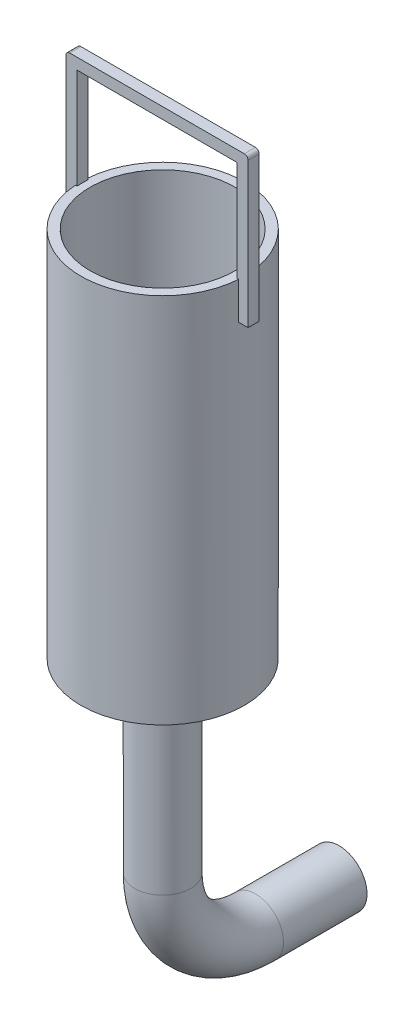
ISO-10303-21;
HEADER;
FILE_DESCRIPTION(('STEP AP214'),'2;1');
FILE_NAME('part.step','',(''),(''),'','','');
FILE_SCHEMA(('AUTOMOTIVE_DESIGN { 1 0 10303 214 1 1 1 1 }'));
ENDSEC;
DATA;
#1=APPLICATION_CONTEXT('core data for automotive mechanical design processes');
#2=APPLICATION_PROTOCOL_DEFINITION('international standard','automotive_design',2000,#1);
#3=PRODUCT_CONTEXT('',#1,'mechanical');
#4=PRODUCT('Part','Part','',(#3));
#5=PRODUCT_RELATED_PRODUCT_CATEGORY('part','',(#4));
#6=PRODUCT_DEFINITION_FORMATION('','',#4);
#7=PRODUCT_DEFINITION_CONTEXT('part definition',#1,'design');
#8=PRODUCT_DEFINITION('design','',#6,#7);
#9=PRODUCT_DEFINITION_SHAPE('','',#8);
#10=(LENGTH_UNIT() NAMED_UNIT(*) SI_UNIT(.MILLI.,.METRE.));
#11=(NAMED_UNIT(*) PLANE_ANGLE_UNIT() SI_UNIT($,.RADIAN.));
#12=(NAMED_UNIT(*) SI_UNIT($,.STERADIAN.) SOLID_ANGLE_UNIT());
#13=UNCERTAINTY_MEASURE_WITH_UNIT(LENGTH_MEASURE(1.E-05),#10,'distance_accuracy_value','');
#14=(GEOMETRIC_REPRESENTATION_CONTEXT(3) GLOBAL_UNCERTAINTY_ASSIGNED_CONTEXT((#13)) GLOBAL_UNIT_ASSIGNED_CONTEXT((#10,
#11,#12)) REPRESENTATION_CONTEXT('',''));
#15=CARTESIAN_POINT('',(0.,0.,0.));
#16=DIRECTION('',(0.,0.,1.));
#17=DIRECTION('',(1.,0.,0.));
#18=AXIS2_PLACEMENT_3D('',#15,#16,#17);
#19=CARTESIAN_POINT('',(0.,0.,0.));
#20=DIRECTION('',(0.,-1.,0.));
#21=DIRECTION('',(0.,0.,-1.));
#22=AXIS2_PLACEMENT_3D('',#19,#20,#21);
#23=PLANE('',#22);
#24=CARTESIAN_POINT('',(0.,0.,0.));
#25=DIRECTION('',(0.,-1.,0.));
#26=DIRECTION('',(0.,0.,-1.));
#27=AXIS2_PLACEMENT_3D('',#24,#25,#26);
#28=CIRCLE('',#27,14.);
#29=CARTESIAN_POINT('',(0.,0.,-14.));
#30=VERTEX_POINT('',#29);
#31=EDGE_CURVE('E90',#30,#30,#28,.T.);
#32=ORIENTED_EDGE('',*,*,#31,.T.);
#33=EDGE_LOOP('',(#32));
#34=FACE_BOUND('',#33,.T.);
#35=CARTESIAN_POINT('',(0.,0.,0.));
#36=DIRECTION('',(0.,-1.,0.));
#37=DIRECTION('',(0.,0.,-1.));
#38=AXIS2_PLACEMENT_3D('',#35,#36,#37);
#39=CIRCLE('',#38,15.);
#40=CARTESIAN_POINT('',(0.,0.,-15.));
#41=VERTEX_POINT('',#40);
#42=EDGE_CURVE('E81',#41,#41,#39,.T.);
#43=ORIENTED_EDGE('',*,*,#42,.F.);
#44=EDGE_LOOP('',(#43));
#45=FACE_BOUND('',#44,.T.);
#46=ADVANCED_FACE('F67',(#34,#45),#23,.F.);
#47=CARTESIAN_POINT('',(4.44089209850063E-13,-149.810784889397,-94.9506304164396));
#48=DIRECTION('',(0.,0.,-1.));
#49=DIRECTION('',(0.,1.,0.));
#50=AXIS2_PLACEMENT_3D('',#47,#48,#49);
#51=PLANE('',#50);
#52=CARTESIAN_POINT('',(4.44089209850063E-13,-149.810784889397,-94.9506304164396));
#53=DIRECTION('',(0.,0.,-1.));
#54=DIRECTION('',(-1.,0.,0.));
#55=AXIS2_PLACEMENT_3D('',#52,#53,#54);
#56=CIRCLE('',#55,14.);
#57=CARTESIAN_POINT('',(-13.9999999999996,-149.810784889397,-94.9506304164397));
#58=VERTEX_POINT('',#57);
#59=EDGE_CURVE('E86',#58,#58,#56,.T.);
#60=ORIENTED_EDGE('',*,*,#59,.F.);
#61=EDGE_LOOP('',(#60));
#62=FACE_BOUND('',#61,.T.);
#63=CARTESIAN_POINT('',(4.44089209850063E-13,-149.810784889397,-94.9506304164396));
#64=DIRECTION('',(0.,0.,-1.));
#65=DIRECTION('',(0.,1.,0.));
#66=AXIS2_PLACEMENT_3D('',#63,#64,#65);
#67=CIRCLE('',#66,15.);
#68=CARTESIAN_POINT('',(4.44089209850063E-13,-134.810784889397,-94.9506304164395));
#69=VERTEX_POINT('',#68);
#70=EDGE_CURVE('E12',#69,#69,#67,.T.);
#71=ORIENTED_EDGE('',*,*,#70,.T.);
#72=EDGE_LOOP('',(#71));
#73=FACE_BOUND('',#72,.T.);
#74=ADVANCED_FACE('F126',(#62,#73),#51,.T.);
#75=CARTESIAN_POINT('',(0.,0.,0.));
#76=DIRECTION('',(0.,-1.,0.));
#77=DIRECTION('',(0.,0.,-1.));
#78=AXIS2_PLACEMENT_3D('',#75,#76,#77);
#79=CYLINDRICAL_SURFACE('',#78,15.);
#80=CARTESIAN_POINT('',(0.,-99.8107848893968,0.));
#81=DIRECTION('',(0.,-1.,0.));
#82=DIRECTION('',(0.,0.,-1.));
#83=AXIS2_PLACEMENT_3D('',#80,#81,#82);
#84=CIRCLE('',#83,15.);
#85=CARTESIAN_POINT('',(0.,-99.8107848893967,15.));
#86=VERTEX_POINT('',#85);
#87=EDGE_CURVE('E77',#86,#86,#84,.T.);
#88=ORIENTED_EDGE('',*,*,#87,.F.);
#89=EDGE_LOOP('',(#88));
#90=FACE_BOUND('',#89,.T.);
#91=ORIENTED_EDGE('',*,*,#42,.T.);
#92=EDGE_LOOP('',(#91));
#93=FACE_BOUND('',#92,.T.);
#94=ADVANCED_FACE('F122',(#90,#93),#79,.T.);
#95=CARTESIAN_POINT('',(0.,-99.8107848893968,-50.));
#96=DIRECTION('',(1.,0.,0.));
#97=DIRECTION('',(0.,0.,-1.));
#98=AXIS2_PLACEMENT_3D('',#95,#96,#97);
#99=TOROIDAL_SURFACE('',#98,50.,15.);
#100=CARTESIAN_POINT('',(0.,-149.810784889397,-50.));
#101=DIRECTION('',(0.,0.,-1.));
#102=DIRECTION('',(0.,1.,0.));
#103=AXIS2_PLACEMENT_3D('',#100,#101,#102);
#104=CIRCLE('',#103,15.);
#105=CARTESIAN_POINT('',(0.,-164.810784889397,-50.));
#106=VERTEX_POINT('',#105);
#107=EDGE_CURVE('E73',#106,#106,#104,.T.);
#108=CARTESIAN_POINT('',(0.,-99.8107848893968,-50.));
#109=DIRECTION('',(1.,0.,0.));
#110=DIRECTION('',(0.,0.,-1.));
#111=AXIS2_PLACEMENT_3D('',#108,#109,#110);
#112=CIRCLE('',#111,65.);
#113=EDGE_CURVE('',#86,#106,#112,.T.);
#114=ORIENTED_EDGE('',*,*,#87,.T.);
#115=ORIENTED_EDGE('',*,*,#107,.F.);
#116=ORIENTED_EDGE('',*,*,#113,.T.);
#117=ORIENTED_EDGE('',*,*,#113,.F.);
#118=EDGE_LOOP('',(#114,#116,#115,#117));
#119=FACE_BOUND('',#118,.T.);
#120=ADVANCED_FACE('F116',(#119),#99,.T.);
#121=CARTESIAN_POINT('',(0.,-149.810784889397,-50.));
#122=DIRECTION('',(0.,0.,-1.));
#123=DIRECTION('',(-1.,0.,0.));
#124=AXIS2_PLACEMENT_3D('',#121,#122,#123);
#125=CYLINDRICAL_SURFACE('',#124,15.);
#126=ORIENTED_EDGE('',*,*,#70,.F.);
#127=EDGE_LOOP('',(#126));
#128=FACE_BOUND('',#127,.T.);
#129=ORIENTED_EDGE('',*,*,#107,.T.);
#130=EDGE_LOOP('',(#129));
#131=FACE_BOUND('',#130,.T.);
#132=ADVANCED_FACE('F113',(#128,#131),#125,.T.);
#133=CARTESIAN_POINT('',(0.,0.,0.));
#134=DIRECTION('',(0.,-1.,0.));
#135=DIRECTION('',(0.,0.,-1.));
#136=AXIS2_PLACEMENT_3D('',#133,#134,#135);
#137=CYLINDRICAL_SURFACE('',#136,14.);
#138=CARTESIAN_POINT('',(0.,-99.8107848893968,0.));
#139=DIRECTION('',(0.,1.,0.));
#140=DIRECTION('',(0.,0.,1.));
#141=AXIS2_PLACEMENT_3D('',#138,#139,#140);
#142=CIRCLE('',#141,14.);
#143=CARTESIAN_POINT('',(0.,-99.8107848893967,14.));
#144=VERTEX_POINT('',#143);
#145=EDGE_CURVE('E93',#144,#144,#142,.F.);
#146=ORIENTED_EDGE('',*,*,#145,.T.);
#147=EDGE_LOOP('',(#146));
#148=FACE_BOUND('',#147,.T.);
#149=ORIENTED_EDGE('',*,*,#31,.F.);
#150=EDGE_LOOP('',(#149));
#151=FACE_BOUND('',#150,.T.);
#152=ADVANCED_FACE('F99',(#148,#151),#137,.F.);
#153=CARTESIAN_POINT('',(0.,-99.8107848893968,-50.));
#154=DIRECTION('',(1.,0.,0.));
#155=DIRECTION('',(0.,0.,-1.));
#156=AXIS2_PLACEMENT_3D('',#153,#154,#155);
#157=TOROIDAL_SURFACE('',#156,50.,14.);
#158=CARTESIAN_POINT('',(0.,-149.810784889397,-50.));
#159=DIRECTION('',(0.,0.,-1.));
#160=DIRECTION('',(-1.,0.,0.));
#161=AXIS2_PLACEMENT_3D('',#158,#159,#160);
#162=CIRCLE('',#161,14.);
#163=CARTESIAN_POINT('',(0.,-163.810784889397,-50.));
#164=VERTEX_POINT('',#163);
#165=EDGE_CURVE('E89',#164,#164,#162,.T.);
#166=CARTESIAN_POINT('',(0.,-99.8107848893968,-50.));
#167=DIRECTION('',(1.,0.,0.));
#168=DIRECTION('',(0.,0.,-1.));
#169=AXIS2_PLACEMENT_3D('',#166,#167,#168);
#170=CIRCLE('',#169,64.);
#171=EDGE_CURVE('',#144,#164,#170,.T.);
#172=ORIENTED_EDGE('',*,*,#145,.F.);
#173=ORIENTED_EDGE('',*,*,#165,.T.);
#174=ORIENTED_EDGE('',*,*,#171,.T.);
#175=ORIENTED_EDGE('',*,*,#171,.F.);
#176=EDGE_LOOP('',(#172,#174,#173,#175));
#177=FACE_BOUND('',#176,.T.);
#178=ADVANCED_FACE('F102',(#177),#157,.F.);
#179=CARTESIAN_POINT('',(0.,-149.810784889397,-50.));
#180=DIRECTION('',(0.,0.,-1.));
#181=DIRECTION('',(-1.,0.,0.));
#182=AXIS2_PLACEMENT_3D('',#179,#180,#181);
#183=CYLINDRICAL_SURFACE('',#182,14.);
#184=ORIENTED_EDGE('',*,*,#59,.T.);
#185=EDGE_LOOP('',(#184));
#186=FACE_BOUND('',#185,.T.);
#187=ORIENTED_EDGE('',*,*,#165,.F.);
#188=EDGE_LOOP('',(#187));
#189=FACE_BOUND('',#188,.T.);
#190=ADVANCED_FACE('F104',(#186,#189),#183,.F.);
#191=CLOSED_SHELL('',(#46,#74,#94,#120,#132,#152,#178,#190));
#192=MANIFOLD_SOLID_BREP('B2',#191);
#193=CARTESIAN_POINT('',(0.,200.,0.));
#194=DIRECTION('',(0.,-1.,0.));
#195=DIRECTION('',(0.,0.,-1.));
#196=AXIS2_PLACEMENT_3D('',#193,#194,#195);
#197=CYLINDRICAL_SURFACE('',#196,44.);
#198=CARTESIAN_POINT('',(0.,0.,0.));
#199=DIRECTION('',(0.,1.,0.));
#200=DIRECTION('',(0.,0.,1.));
#201=AXIS2_PLACEMENT_3D('',#198,#199,#200);
#202=CIRCLE('',#201,44.);
#203=CARTESIAN_POINT('',(0.,0.,44.));
#204=VERTEX_POINT('',#203);
#205=EDGE_CURVE('E398',#204,#204,#202,.T.);
#206=ORIENTED_EDGE('',*,*,#205,.T.);
#207=EDGE_LOOP('',(#206));
#208=FACE_BOUND('',#207,.T.);
#209=DIRECTION('',(0.,-1.,0.));
#210=VECTOR('',#209,1.);
#211=CARTESIAN_POINT('',(-43.8976081352959,200.,-3.));
#212=LINE('',#211,#210);
#213=CARTESIAN_POINT('',(-43.8976081352959,200.,-3.));
#214=VERTEX_POINT('',#213);
#215=CARTESIAN_POINT('',(-43.8976081352959,180.,-3.));
#216=VERTEX_POINT('',#215);
#217=EDGE_CURVE('E385',#214,#216,#212,.T.);
#218=ORIENTED_EDGE('',*,*,#217,.F.);
#219=CARTESIAN_POINT('',(0.,200.,0.));
#220=DIRECTION('',(0.,1.,0.));
#221=DIRECTION('',(0.,0.,1.));
#222=AXIS2_PLACEMENT_3D('',#219,#220,#221);
#223=CIRCLE('',#222,44.);
#224=CARTESIAN_POINT('',(43.8976081352959,200.,-3.));
#225=VERTEX_POINT('',#224);
#226=EDGE_CURVE('E403',#225,#214,#223,.T.);
#227=ORIENTED_EDGE('',*,*,#226,.F.);
#228=DIRECTION('',(0.,-1.,0.));
#229=VECTOR('',#228,1.);
#230=CARTESIAN_POINT('',(43.8976081352959,200.,-3.));
#231=LINE('',#230,#229);
#232=CARTESIAN_POINT('',(43.8976081352959,180.,-3.));
#233=VERTEX_POINT('',#232);
#234=EDGE_CURVE('E382',#233,#225,#231,.F.);
#235=ORIENTED_EDGE('',*,*,#234,.F.);
#236=CARTESIAN_POINT('',(0.,180.,0.));
#237=DIRECTION('',(0.,1.,0.));
#238=DIRECTION('',(0.,0.,1.));
#239=AXIS2_PLACEMENT_3D('',#236,#237,#238);
#240=CIRCLE('',#239,44.);
#241=CARTESIAN_POINT('',(43.8976081352959,180.,3.));
#242=VERTEX_POINT('',#241);
#243=EDGE_CURVE('E418',#242,#233,#240,.T.);
#244=ORIENTED_EDGE('',*,*,#243,.F.);
#245=DIRECTION('',(0.,-1.,0.));
#246=VECTOR('',#245,1.);
#247=CARTESIAN_POINT('',(43.8976081352959,200.,3.));
#248=LINE('',#247,#246);
#249=CARTESIAN_POINT('',(43.8976081352959,200.,3.));
#250=VERTEX_POINT('',#249);
#251=EDGE_CURVE('E339',#242,#250,#248,.F.);
#252=ORIENTED_EDGE('',*,*,#251,.T.);
#253=CARTESIAN_POINT('',(-43.8976081352959,200.,3.));
#254=VERTEX_POINT('',#253);
#255=EDGE_CURVE('E401',#254,#250,#223,.T.);
#256=ORIENTED_EDGE('',*,*,#255,.F.);
#257=DIRECTION('',(0.,-1.,0.));
#258=VECTOR('',#257,1.);
#259=CARTESIAN_POINT('',(-43.8976081352959,200.,3.));
#260=LINE('',#259,#258);
#261=CARTESIAN_POINT('',(-43.8976081352959,180.,3.));
#262=VERTEX_POINT('',#261);
#263=EDGE_CURVE('E380',#254,#262,#260,.T.);
#264=ORIENTED_EDGE('',*,*,#263,.T.);
#265=CARTESIAN_POINT('',(0.,180.,0.));
#266=DIRECTION('',(0.,1.,0.));
#267=DIRECTION('',(0.,0.,1.));
#268=AXIS2_PLACEMENT_3D('',#265,#266,#267);
#269=CIRCLE('',#268,44.);
#270=EDGE_CURVE('E420',#216,#262,#269,.T.);
#271=ORIENTED_EDGE('',*,*,#270,.F.);
#272=EDGE_LOOP('',(#218,#227,#235,#244,#252,#256,#264,#271));
#273=FACE_BOUND('',#272,.T.);
#274=ADVANCED_FACE('F210',(#208,#273),#197,.T.);
#275=CARTESIAN_POINT('',(0.,200.,0.));
#276=DIRECTION('',(0.,1.,0.));
#277=DIRECTION('',(0.,0.,1.));
#278=AXIS2_PLACEMENT_3D('',#275,#276,#277);
#279=PLANE('',#278);
#280=CARTESIAN_POINT('',(0.,200.,0.));
#281=DIRECTION('',(0.,1.,0.));
#282=DIRECTION('',(0.,0.,1.));
#283=AXIS2_PLACEMENT_3D('',#280,#281,#282);
#284=CIRCLE('',#283,39.);
#285=CARTESIAN_POINT('',(0.,200.,39.));
#286=VERTEX_POINT('',#285);
#287=EDGE_CURVE('E394',#286,#286,#284,.T.);
#288=ORIENTED_EDGE('',*,*,#287,.F.);
#289=EDGE_LOOP('',(#288));
#290=FACE_BOUND('',#289,.T.);
#291=ORIENTED_EDGE('',*,*,#226,.T.);
#292=DIRECTION('',(1.,0.,0.));
#293=VECTOR('',#292,1.);
#294=CARTESIAN_POINT('',(0.,200.,-3.));
#295=LINE('',#294,#293);
#296=CARTESIAN_POINT('',(-43.040737884966,200.,-3.));
#297=VERTEX_POINT('',#296);
#298=EDGE_CURVE('E414',#214,#297,#295,.T.);
#299=ORIENTED_EDGE('',*,*,#298,.T.);
#300=DIRECTION('',(0.,0.,-1.));
#301=VECTOR('',#300,1.);
#302=CARTESIAN_POINT('',(-43.040737884966,200.,0.));
#303=LINE('',#302,#301);
#304=CARTESIAN_POINT('',(-43.040737884966,200.,3.));
#305=VERTEX_POINT('',#304);
#306=EDGE_CURVE('E415',#305,#297,#303,.T.);
#307=ORIENTED_EDGE('',*,*,#306,.F.);
#308=DIRECTION('',(1.,0.,0.));
#309=VECTOR('',#308,1.);
#310=CARTESIAN_POINT('',(0.,200.,3.));
#311=LINE('',#310,#309);
#312=EDGE_CURVE('E409',#254,#305,#311,.T.);
#313=ORIENTED_EDGE('',*,*,#312,.F.);
#314=ORIENTED_EDGE('',*,*,#255,.T.);
#315=CARTESIAN_POINT('',(42.9427831631923,200.,3.));
#316=VERTEX_POINT('',#315);
#317=EDGE_CURVE('E406',#316,#250,#311,.T.);
#318=ORIENTED_EDGE('',*,*,#317,.F.);
#319=DIRECTION('',(0.,0.,1.));
#320=VECTOR('',#319,1.);
#321=CARTESIAN_POINT('',(42.9427831631923,200.,0.));
#322=LINE('',#321,#320);
#323=CARTESIAN_POINT('',(42.9427831631923,200.,-3.));
#324=VERTEX_POINT('',#323);
#325=EDGE_CURVE('E408',#324,#316,#322,.T.);
#326=ORIENTED_EDGE('',*,*,#325,.F.);
#327=EDGE_CURVE('E412',#324,#225,#295,.T.);
#328=ORIENTED_EDGE('',*,*,#327,.T.);
#329=EDGE_LOOP('',(#291,#299,#307,#313,#314,#318,#326,#328));
#330=FACE_BOUND('',#329,.T.);
#331=ADVANCED_FACE('F456',(#290,#330),#279,.T.);
#332=CARTESIAN_POINT('',(0.,0.,0.));
#333=DIRECTION('',(0.,1.,0.));
#334=DIRECTION('',(0.,0.,1.));
#335=AXIS2_PLACEMENT_3D('',#332,#333,#334);
#336=PLANE('',#335);
#337=CARTESIAN_POINT('',(0.,0.,0.));
#338=DIRECTION('',(0.,1.,0.));
#339=DIRECTION('',(0.,0.,1.));
#340=AXIS2_PLACEMENT_3D('',#337,#338,#339);
#341=CIRCLE('',#340,15.7);
#342=CARTESIAN_POINT('',(0.,0.,15.7));
#343=VERTEX_POINT('',#342);
#344=EDGE_CURVE('E391',#343,#343,#341,.F.);
#345=ORIENTED_EDGE('',*,*,#344,.F.);
#346=EDGE_LOOP('',(#345));
#347=FACE_BOUND('',#346,.T.);
#348=ORIENTED_EDGE('',*,*,#205,.F.);
#349=EDGE_LOOP('',(#348));
#350=FACE_BOUND('',#349,.T.);
#351=ADVANCED_FACE('F483',(#347,#350),#336,.F.);
#352=CARTESIAN_POINT('',(0.,8.00000000000001,0.));
#353=DIRECTION('',(0.,1.,0.));
#354=DIRECTION('',(0.,0.,1.));
#355=AXIS2_PLACEMENT_3D('',#352,#353,#354);
#356=CYLINDRICAL_SURFACE('',#355,39.);
#357=CARTESIAN_POINT('',(0.,8.00000000000001,0.));
#358=DIRECTION('',(0.,1.,0.));
#359=DIRECTION('',(0.,0.,1.));
#360=AXIS2_PLACEMENT_3D('',#357,#358,#359);
#361=CIRCLE('',#360,39.);
#362=CARTESIAN_POINT('',(0.,8.00000000000001,39.));
#363=VERTEX_POINT('',#362);
#364=EDGE_CURVE('E395',#363,#363,#361,.T.);
#365=ORIENTED_EDGE('',*,*,#364,.F.);
#366=EDGE_LOOP('',(#365));
#367=FACE_BOUND('',#366,.T.);
#368=ORIENTED_EDGE('',*,*,#287,.T.);
#369=EDGE_LOOP('',(#368));
#370=FACE_BOUND('',#369,.T.);
#371=ADVANCED_FACE('F488',(#367,#370),#356,.F.);
#372=CARTESIAN_POINT('',(0.,8.00000000000001,0.));
#373=DIRECTION('',(0.,1.,0.));
#374=DIRECTION('',(0.,0.,1.));
#375=AXIS2_PLACEMENT_3D('',#372,#373,#374);
#376=PLANE('',#375);
#377=CARTESIAN_POINT('',(0.,8.00000000000001,0.));
#378=DIRECTION('',(0.,1.,0.));
#379=DIRECTION('',(0.,0.,1.));
#380=AXIS2_PLACEMENT_3D('',#377,#378,#379);
#381=CIRCLE('',#380,15.7);
#382=CARTESIAN_POINT('',(0.,8.00000000000001,15.7));
#383=VERTEX_POINT('',#382);
#384=EDGE_CURVE('E388',#383,#383,#381,.T.);
#385=ORIENTED_EDGE('',*,*,#384,.F.);
#386=EDGE_LOOP('',(#385));
#387=FACE_BOUND('',#386,.T.);
#388=ORIENTED_EDGE('',*,*,#364,.T.);
#389=EDGE_LOOP('',(#388));
#390=FACE_BOUND('',#389,.T.);
#391=ADVANCED_FACE('F493',(#387,#390),#376,.T.);
#392=CARTESIAN_POINT('',(0.,-0.000999999999999265,0.));
#393=DIRECTION('',(0.,1.,0.));
#394=DIRECTION('',(0.,0.,1.));
#395=AXIS2_PLACEMENT_3D('',#392,#393,#394);
#396=CYLINDRICAL_SURFACE('',#395,15.7);
#397=ORIENTED_EDGE('',*,*,#384,.T.);
#398=EDGE_LOOP('',(#397));
#399=FACE_BOUND('',#398,.T.);
#400=ORIENTED_EDGE('',*,*,#344,.T.);
#401=EDGE_LOOP('',(#400));
#402=FACE_BOUND('',#401,.T.);
#403=ADVANCED_FACE('F497',(#399,#402),#396,.F.);
#404=CARTESIAN_POINT('',(0.,0.,-3.));
#405=DIRECTION('',(0.,0.,1.));
#406=DIRECTION('',(1.,0.,0.));
#407=AXIS2_PLACEMENT_3D('',#404,#405,#406);
#408=PLANE('',#407);
#409=DIRECTION('',(0.,1.,0.));
#410=VECTOR('',#409,1.);
#411=CARTESIAN_POINT('',(-49.040737884966,0.,-3.));
#412=LINE('',#411,#410);
#413=CARTESIAN_POINT('',(-49.040737884966,180.,-3.));
#414=VERTEX_POINT('',#413);
#415=CARTESIAN_POINT('',(-49.040737884966,258.,-3.));
#416=VERTEX_POINT('',#415);
#417=EDGE_CURVE('E364',#414,#416,#412,.T.);
#418=ORIENTED_EDGE('',*,*,#417,.T.);
#419=CARTESIAN_POINT('',(-47.040737884966,258.,-3.));
#420=DIRECTION('',(0.,0.,1.));
#421=DIRECTION('',(1.,0.,0.));
#422=AXIS2_PLACEMENT_3D('',#419,#420,#421);
#423=CIRCLE('',#422,2.);
#424=CARTESIAN_POINT('',(-47.040737884966,260.,-3.));
#425=VERTEX_POINT('',#424);
#426=EDGE_CURVE('E218',#416,#425,#423,.F.);
#427=ORIENTED_EDGE('',*,*,#426,.T.);
#428=DIRECTION('',(1.,0.,0.));
#429=VECTOR('',#428,1.);
#430=CARTESIAN_POINT('',(0.,260.,-3.));
#431=LINE('',#430,#429);
#432=CARTESIAN_POINT('',(46.9427831631922,260.,-3.));
#433=VERTEX_POINT('',#432);
#434=EDGE_CURVE('E362',#425,#433,#431,.T.);
#435=ORIENTED_EDGE('',*,*,#434,.T.);
#436=CARTESIAN_POINT('',(46.9427831631922,258.,-3.));
#437=DIRECTION('',(0.,0.,1.));
#438=DIRECTION('',(1.,0.,0.));
#439=AXIS2_PLACEMENT_3D('',#436,#437,#438);
#440=CIRCLE('',#439,2.);
#441=CARTESIAN_POINT('',(48.9427831631922,258.,-3.));
#442=VERTEX_POINT('',#441);
#443=EDGE_CURVE('E225',#433,#442,#440,.F.);
#444=ORIENTED_EDGE('',*,*,#443,.T.);
#445=DIRECTION('',(0.,-1.,0.));
#446=VECTOR('',#445,1.);
#447=CARTESIAN_POINT('',(48.9427831631923,0.,-3.));
#448=LINE('',#447,#446);
#449=CARTESIAN_POINT('',(48.9427831631922,180.,-3.));
#450=VERTEX_POINT('',#449);
#451=EDGE_CURVE('E360',#442,#450,#448,.T.);
#452=ORIENTED_EDGE('',*,*,#451,.T.);
#453=DIRECTION('',(-1.,0.,0.));
#454=VECTOR('',#453,1.);
#455=CARTESIAN_POINT('',(0.,180.,-3.));
#456=LINE('',#455,#454);
#457=EDGE_CURVE('E330',#450,#233,#456,.T.);
#458=ORIENTED_EDGE('',*,*,#457,.T.);
#459=ORIENTED_EDGE('',*,*,#234,.T.);
#460=ORIENTED_EDGE('',*,*,#327,.F.);
#461=DIRECTION('',(0.,-1.,0.));
#462=VECTOR('',#461,1.);
#463=CARTESIAN_POINT('',(42.9427831631923,0.,-3.));
#464=LINE('',#463,#462);
#465=CARTESIAN_POINT('',(42.9427831631922,254.,-3.));
#466=VERTEX_POINT('',#465);
#467=EDGE_CURVE('E356',#466,#324,#464,.T.);
#468=ORIENTED_EDGE('',*,*,#467,.F.);
#469=DIRECTION('',(1.,0.,0.));
#470=VECTOR('',#469,1.);
#471=CARTESIAN_POINT('',(0.,254.,-3.));
#472=LINE('',#471,#470);
#473=CARTESIAN_POINT('',(-43.040737884966,254.,-3.));
#474=VERTEX_POINT('',#473);
#475=EDGE_CURVE('E332',#474,#466,#472,.T.);
#476=ORIENTED_EDGE('',*,*,#475,.F.);
#477=DIRECTION('',(0.,1.,0.));
#478=VECTOR('',#477,1.);
#479=CARTESIAN_POINT('',(-43.040737884966,0.,-3.));
#480=LINE('',#479,#478);
#481=EDGE_CURVE('E368',#297,#474,#480,.T.);
#482=ORIENTED_EDGE('',*,*,#481,.F.);
#483=ORIENTED_EDGE('',*,*,#298,.F.);
#484=ORIENTED_EDGE('',*,*,#217,.T.);
#485=DIRECTION('',(-1.,0.,0.));
#486=VECTOR('',#485,1.);
#487=CARTESIAN_POINT('',(0.,180.,-3.));
#488=LINE('',#487,#486);
#489=EDGE_CURVE('E366',#216,#414,#488,.T.);
#490=ORIENTED_EDGE('',*,*,#489,.T.);
#491=EDGE_LOOP('',(#418,#427,#435,#444,#452,#458,#459,#460,#468,#476,#482,#483,#484,#490));
#492=FACE_BOUND('',#491,.T.);
#493=ADVANCED_FACE('F435',(#492),#408,.F.);
#494=CARTESIAN_POINT('',(0.,0.,3.));
#495=DIRECTION('',(0.,0.,1.));
#496=DIRECTION('',(1.,0.,0.));
#497=AXIS2_PLACEMENT_3D('',#494,#495,#496);
#498=PLANE('',#497);
#499=DIRECTION('',(1.,0.,0.));
#500=VECTOR('',#499,1.);
#501=CARTESIAN_POINT('',(0.,260.,3.));
#502=LINE('',#501,#500);
#503=CARTESIAN_POINT('',(-47.040737884966,260.,3.));
#504=VERTEX_POINT('',#503);
#505=CARTESIAN_POINT('',(46.9427831631922,260.,3.));
#506=VERTEX_POINT('',#505);
#507=EDGE_CURVE('E322',#504,#506,#502,.T.);
#508=ORIENTED_EDGE('',*,*,#507,.F.);
#509=CARTESIAN_POINT('',(-47.040737884966,258.,3.));
#510=DIRECTION('',(0.,0.,1.));
#511=DIRECTION('',(1.,0.,0.));
#512=AXIS2_PLACEMENT_3D('',#509,#510,#511);
#513=CIRCLE('',#512,2.);
#514=CARTESIAN_POINT('',(-49.040737884966,258.,3.));
#515=VERTEX_POINT('',#514);
#516=EDGE_CURVE('E430',#504,#515,#513,.T.);
#517=ORIENTED_EDGE('',*,*,#516,.T.);
#518=DIRECTION('',(0.,1.,0.));
#519=VECTOR('',#518,1.);
#520=CARTESIAN_POINT('',(-49.040737884966,0.,3.));
#521=LINE('',#520,#519);
#522=CARTESIAN_POINT('',(-49.040737884966,180.,3.));
#523=VERTEX_POINT('',#522);
#524=EDGE_CURVE('E347',#523,#515,#521,.T.);
#525=ORIENTED_EDGE('',*,*,#524,.F.);
#526=DIRECTION('',(-1.,0.,0.));
#527=VECTOR('',#526,1.);
#528=CARTESIAN_POINT('',(0.,180.,3.));
#529=LINE('',#528,#527);
#530=EDGE_CURVE('E349',#262,#523,#529,.T.);
#531=ORIENTED_EDGE('',*,*,#530,.F.);
#532=ORIENTED_EDGE('',*,*,#263,.F.);
#533=ORIENTED_EDGE('',*,*,#312,.T.);
#534=DIRECTION('',(0.,1.,0.));
#535=VECTOR('',#534,1.);
#536=CARTESIAN_POINT('',(-43.040737884966,0.,3.));
#537=LINE('',#536,#535);
#538=CARTESIAN_POINT('',(-43.040737884966,254.,3.));
#539=VERTEX_POINT('',#538);
#540=EDGE_CURVE('E351',#305,#539,#537,.T.);
#541=ORIENTED_EDGE('',*,*,#540,.T.);
#542=DIRECTION('',(1.,0.,0.));
#543=VECTOR('',#542,1.);
#544=CARTESIAN_POINT('',(0.,254.,3.));
#545=LINE('',#544,#543);
#546=CARTESIAN_POINT('',(42.9427831631922,254.,3.));
#547=VERTEX_POINT('',#546);
#548=EDGE_CURVE('E353',#539,#547,#545,.T.);
#549=ORIENTED_EDGE('',*,*,#548,.T.);
#550=DIRECTION('',(0.,-1.,0.));
#551=VECTOR('',#550,1.);
#552=CARTESIAN_POINT('',(42.9427831631923,0.,3.));
#553=LINE('',#552,#551);
#554=EDGE_CURVE('E340',#547,#316,#553,.T.);
#555=ORIENTED_EDGE('',*,*,#554,.T.);
#556=ORIENTED_EDGE('',*,*,#317,.T.);
#557=ORIENTED_EDGE('',*,*,#251,.F.);
#558=DIRECTION('',(-1.,0.,0.));
#559=VECTOR('',#558,1.);
#560=CARTESIAN_POINT('',(0.,180.,3.));
#561=LINE('',#560,#559);
#562=CARTESIAN_POINT('',(48.9427831631922,180.,3.));
#563=VERTEX_POINT('',#562);
#564=EDGE_CURVE('E323',#563,#242,#561,.T.);
#565=ORIENTED_EDGE('',*,*,#564,.F.);
#566=DIRECTION('',(0.,-1.,0.));
#567=VECTOR('',#566,1.);
#568=CARTESIAN_POINT('',(48.9427831631923,0.,3.));
#569=LINE('',#568,#567);
#570=CARTESIAN_POINT('',(48.9427831631922,258.,3.));
#571=VERTEX_POINT('',#570);
#572=EDGE_CURVE('E314',#571,#563,#569,.T.);
#573=ORIENTED_EDGE('',*,*,#572,.F.);
#574=CARTESIAN_POINT('',(46.9427831631922,258.,3.));
#575=DIRECTION('',(0.,0.,1.));
#576=DIRECTION('',(1.,0.,0.));
#577=AXIS2_PLACEMENT_3D('',#574,#575,#576);
#578=CIRCLE('',#577,2.);
#579=EDGE_CURVE('E428',#571,#506,#578,.T.);
#580=ORIENTED_EDGE('',*,*,#579,.T.);
#581=EDGE_LOOP('',(#508,#517,#525,#531,#532,#533,#541,#549,#555,#556,#557,#565,#573,#580));
#582=FACE_BOUND('',#581,.T.);
#583=ADVANCED_FACE('F336',(#582),#498,.T.);
#584=CARTESIAN_POINT('',(42.9427831631923,0.,-3.));
#585=DIRECTION('',(-1.,0.,0.));
#586=DIRECTION('',(0.,-1.,0.));
#587=AXIS2_PLACEMENT_3D('',#584,#585,#586);
#588=PLANE('',#587);
#589=ORIENTED_EDGE('',*,*,#467,.T.);
#590=ORIENTED_EDGE('',*,*,#325,.T.);
#591=ORIENTED_EDGE('',*,*,#554,.F.);
#592=DIRECTION('',(0.,0.,1.));
#593=VECTOR('',#592,1.);
#594=CARTESIAN_POINT('',(42.9427831631922,254.,-3.));
#595=LINE('',#594,#593);
#596=EDGE_CURVE('E372',#466,#547,#595,.T.);
#597=ORIENTED_EDGE('',*,*,#596,.F.);
#598=EDGE_LOOP('',(#589,#590,#591,#597));
#599=FACE_BOUND('',#598,.T.);
#600=ADVANCED_FACE('F470',(#599),#588,.T.);
#601=CARTESIAN_POINT('',(0.,254.,-3.));
#602=DIRECTION('',(0.,-1.,0.));
#603=DIRECTION('',(0.,0.,-1.));
#604=AXIS2_PLACEMENT_3D('',#601,#602,#603);
#605=PLANE('',#604);
#606=ORIENTED_EDGE('',*,*,#596,.T.);
#607=ORIENTED_EDGE('',*,*,#548,.F.);
#608=DIRECTION('',(0.,0.,1.));
#609=VECTOR('',#608,1.);
#610=CARTESIAN_POINT('',(-43.040737884966,254.,-3.));
#611=LINE('',#610,#609);
#612=EDGE_CURVE('E374',#474,#539,#611,.T.);
#613=ORIENTED_EDGE('',*,*,#612,.F.);
#614=ORIENTED_EDGE('',*,*,#475,.T.);
#615=EDGE_LOOP('',(#606,#607,#613,#614));
#616=FACE_BOUND('',#615,.T.);
#617=ADVANCED_FACE('F466',(#616),#605,.T.);
#618=CARTESIAN_POINT('',(-43.040737884966,0.,-3.));
#619=DIRECTION('',(1.,0.,0.));
#620=DIRECTION('',(0.,0.,-1.));
#621=AXIS2_PLACEMENT_3D('',#618,#619,#620);
#622=PLANE('',#621);
#623=ORIENTED_EDGE('',*,*,#540,.F.);
#624=ORIENTED_EDGE('',*,*,#306,.T.);
#625=ORIENTED_EDGE('',*,*,#481,.T.);
#626=ORIENTED_EDGE('',*,*,#612,.T.);
#627=EDGE_LOOP('',(#623,#624,#625,#626));
#628=FACE_BOUND('',#627,.T.);
#629=ADVANCED_FACE('F460',(#628),#622,.T.);
#630=CARTESIAN_POINT('',(0.,180.,-3.));
#631=DIRECTION('',(0.,1.,0.));
#632=DIRECTION('',(0.,0.,1.));
#633=AXIS2_PLACEMENT_3D('',#630,#631,#632);
#634=PLANE('',#633);
#635=ORIENTED_EDGE('',*,*,#489,.F.);
#636=ORIENTED_EDGE('',*,*,#270,.T.);
#637=ORIENTED_EDGE('',*,*,#530,.T.);
#638=DIRECTION('',(0.,0.,1.));
#639=VECTOR('',#638,1.);
#640=CARTESIAN_POINT('',(-49.040737884966,180.,-3.));
#641=LINE('',#640,#639);
#642=EDGE_CURVE('E331',#414,#523,#641,.T.);
#643=ORIENTED_EDGE('',*,*,#642,.F.);
#644=EDGE_LOOP('',(#635,#636,#637,#643));
#645=FACE_BOUND('',#644,.T.);
#646=ADVANCED_FACE('F448',(#645),#634,.F.);
#647=CARTESIAN_POINT('',(-49.040737884966,0.,-3.));
#648=DIRECTION('',(1.,0.,0.));
#649=DIRECTION('',(0.,0.,-1.));
#650=AXIS2_PLACEMENT_3D('',#647,#648,#649);
#651=PLANE('',#650);
#652=ORIENTED_EDGE('',*,*,#524,.T.);
#653=DIRECTION('',(0.,0.,1.));
#654=VECTOR('',#653,1.);
#655=CARTESIAN_POINT('',(-49.040737884966,258.,-3.));
#656=LINE('',#655,#654);
#657=EDGE_CURVE('E233',#515,#416,#656,.F.);
#658=ORIENTED_EDGE('',*,*,#657,.T.);
#659=ORIENTED_EDGE('',*,*,#417,.F.);
#660=ORIENTED_EDGE('',*,*,#642,.T.);
#661=EDGE_LOOP('',(#652,#658,#659,#660));
#662=FACE_BOUND('',#661,.T.);
#663=ADVANCED_FACE('F444',(#662),#651,.F.);
#664=CARTESIAN_POINT('',(0.,260.,-3.));
#665=DIRECTION('',(0.,-1.,0.));
#666=DIRECTION('',(0.,0.,-1.));
#667=AXIS2_PLACEMENT_3D('',#664,#665,#666);
#668=PLANE('',#667);
#669=ORIENTED_EDGE('',*,*,#434,.F.);
#670=DIRECTION('',(0.,0.,1.));
#671=VECTOR('',#670,1.);
#672=CARTESIAN_POINT('',(-47.040737884966,260.,-3.));
#673=LINE('',#672,#671);
#674=EDGE_CURVE('E425',#425,#504,#673,.T.);
#675=ORIENTED_EDGE('',*,*,#674,.T.);
#676=ORIENTED_EDGE('',*,*,#507,.T.);
#677=DIRECTION('',(0.,0.,1.));
#678=VECTOR('',#677,1.);
#679=CARTESIAN_POINT('',(46.9427831631922,260.,-3.));
#680=LINE('',#679,#678);
#681=EDGE_CURVE('E423',#506,#433,#680,.F.);
#682=ORIENTED_EDGE('',*,*,#681,.T.);
#683=EDGE_LOOP('',(#669,#675,#676,#682));
#684=FACE_BOUND('',#683,.T.);
#685=ADVANCED_FACE('F439',(#684),#668,.F.);
#686=CARTESIAN_POINT('',(48.9427831631923,0.,-3.));
#687=DIRECTION('',(-1.,0.,0.));
#688=DIRECTION('',(0.,-1.,0.));
#689=AXIS2_PLACEMENT_3D('',#686,#687,#688);
#690=PLANE('',#689);
#691=ORIENTED_EDGE('',*,*,#451,.F.);
#692=DIRECTION('',(0.,0.,1.));
#693=VECTOR('',#692,1.);
#694=CARTESIAN_POINT('',(48.9427831631922,258.,-3.));
#695=LINE('',#694,#693);
#696=EDGE_CURVE('E65',#442,#571,#695,.T.);
#697=ORIENTED_EDGE('',*,*,#696,.T.);
#698=ORIENTED_EDGE('',*,*,#572,.T.);
#699=DIRECTION('',(0.,0.,1.));
#700=VECTOR('',#699,1.);
#701=CARTESIAN_POINT('',(48.9427831631922,180.,-3.));
#702=LINE('',#701,#700);
#703=EDGE_CURVE('E317',#450,#563,#702,.T.);
#704=ORIENTED_EDGE('',*,*,#703,.F.);
#705=EDGE_LOOP('',(#691,#697,#698,#704));
#706=FACE_BOUND('',#705,.T.);
#707=ADVANCED_FACE('F316',(#706),#690,.F.);
#708=CARTESIAN_POINT('',(0.,180.,-3.));
#709=DIRECTION('',(0.,1.,0.));
#710=DIRECTION('',(0.,0.,1.));
#711=AXIS2_PLACEMENT_3D('',#708,#709,#710);
#712=PLANE('',#711);
#713=ORIENTED_EDGE('',*,*,#564,.T.);
#714=ORIENTED_EDGE('',*,*,#243,.T.);
#715=ORIENTED_EDGE('',*,*,#457,.F.);
#716=ORIENTED_EDGE('',*,*,#703,.T.);
#717=EDGE_LOOP('',(#713,#714,#715,#716));
#718=FACE_BOUND('',#717,.T.);
#719=ADVANCED_FACE('F327',(#718),#712,.F.);
#720=CARTESIAN_POINT('',(-47.040737884966,258.,-3.));
#721=DIRECTION('',(0.,0.,1.));
#722=DIRECTION('',(1.,0.,0.));
#723=AXIS2_PLACEMENT_3D('',#720,#721,#722);
#724=CYLINDRICAL_SURFACE('',#723,2.);
#725=ORIENTED_EDGE('',*,*,#426,.F.);
#726=ORIENTED_EDGE('',*,*,#657,.F.);
#727=ORIENTED_EDGE('',*,*,#516,.F.);
#728=ORIENTED_EDGE('',*,*,#674,.F.);
#729=EDGE_LOOP('',(#725,#726,#727,#728));
#730=FACE_BOUND('',#729,.T.);
#731=ADVANCED_FACE('F441',(#730),#724,.T.);
#732=CARTESIAN_POINT('',(46.9427831631922,258.,-3.));
#733=DIRECTION('',(0.,0.,1.));
#734=DIRECTION('',(1.,0.,0.));
#735=AXIS2_PLACEMENT_3D('',#732,#733,#734);
#736=CYLINDRICAL_SURFACE('',#735,2.);
#737=ORIENTED_EDGE('',*,*,#443,.F.);
#738=ORIENTED_EDGE('',*,*,#681,.F.);
#739=ORIENTED_EDGE('',*,*,#579,.F.);
#740=ORIENTED_EDGE('',*,*,#696,.F.);
#741=EDGE_LOOP('',(#737,#738,#739,#740));
#742=FACE_BOUND('',#741,.T.);
#743=ADVANCED_FACE('F212',(#742),#736,.T.);
#744=CLOSED_SHELL('',(#274,#331,#351,#371,#391,#403,#493,#583,#600,#617,#629,#646,#663,#685,
#707,#719,#731,#743));
#745=MANIFOLD_SOLID_BREP('B7',#744);
#746=ADVANCED_BREP_SHAPE_REPRESENTATION('',(#18,#192,#745),#14);
#747=SHAPE_DEFINITION_REPRESENTATION(#9,#746);
ENDSEC;
END-ISO-10303-21;
